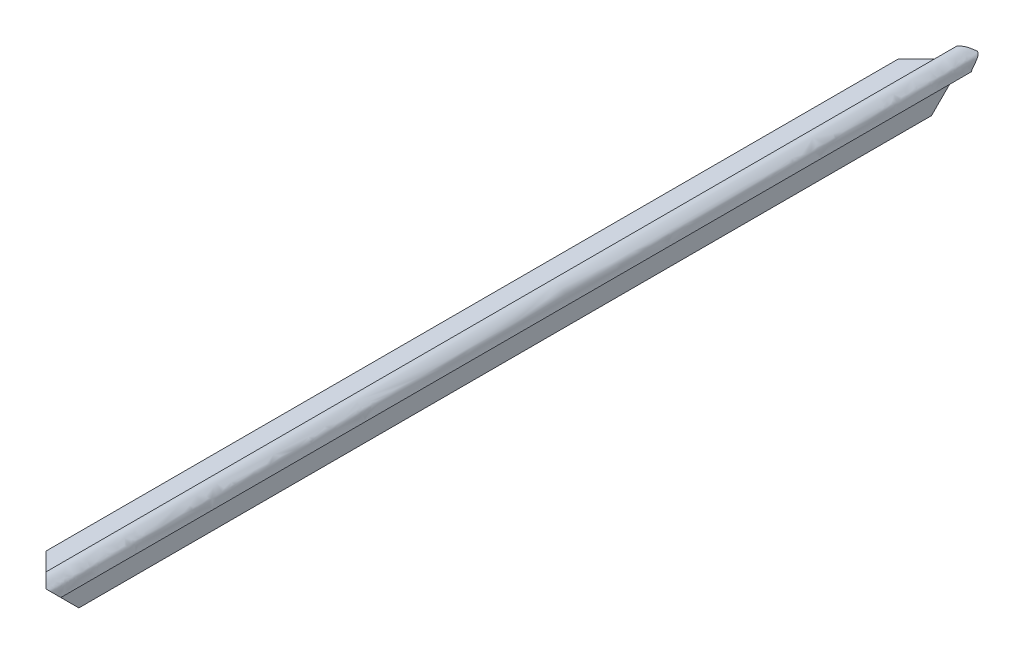
ISO-10303-21;
HEADER;
FILE_DESCRIPTION(('STEP AP214'),'2;1');
FILE_NAME('part.step','',(''),(''),'','','');
FILE_SCHEMA(('AUTOMOTIVE_DESIGN { 1 0 10303 214 1 1 1 1 }'));
ENDSEC;
DATA;
#1=APPLICATION_CONTEXT('core data for automotive mechanical design processes');
#2=APPLICATION_PROTOCOL_DEFINITION('international standard','automotive_design',2000,#1);
#3=PRODUCT_CONTEXT('',#1,'mechanical');
#4=PRODUCT('Part','Part','',(#3));
#5=PRODUCT_RELATED_PRODUCT_CATEGORY('part','',(#4));
#6=PRODUCT_DEFINITION_FORMATION('','',#4);
#7=PRODUCT_DEFINITION_CONTEXT('part definition',#1,'design');
#8=PRODUCT_DEFINITION('design','',#6,#7);
#9=PRODUCT_DEFINITION_SHAPE('','',#8);
#10=(LENGTH_UNIT() NAMED_UNIT(*) SI_UNIT(.MILLI.,.METRE.));
#11=(NAMED_UNIT(*) PLANE_ANGLE_UNIT() SI_UNIT($,.RADIAN.));
#12=(NAMED_UNIT(*) SI_UNIT($,.STERADIAN.) SOLID_ANGLE_UNIT());
#13=UNCERTAINTY_MEASURE_WITH_UNIT(LENGTH_MEASURE(1.E-05),#10,'distance_accuracy_value','');
#14=(GEOMETRIC_REPRESENTATION_CONTEXT(3) GLOBAL_UNCERTAINTY_ASSIGNED_CONTEXT((#13)) GLOBAL_UNIT_ASSIGNED_CONTEXT((#10,
#11,#12)) REPRESENTATION_CONTEXT('',''));
#15=CARTESIAN_POINT('',(0.,0.,0.));
#16=DIRECTION('',(0.,0.,1.));
#17=DIRECTION('',(1.,0.,0.));
#18=AXIS2_PLACEMENT_3D('',#15,#16,#17);
#19=CARTESIAN_POINT('',(-10.4775,-4.500000144,130.175));
#20=DIRECTION('',(0.,1.,0.));
#21=DIRECTION('',(0.,0.,1.));
#22=AXIS2_PLACEMENT_3D('',#19,#20,#21);
#23=PLANE('',#22);
#24=DIRECTION('',(0.,0.,-1.));
#25=VECTOR('',#24,1.);
#26=CARTESIAN_POINT('',(-6.7450641742673,-4.500000144,130.175));
#27=LINE('',#26,#25);
#28=CARTESIAN_POINT('',(-6.7450641742673,-4.500000144,120.254935825733));
#29=VERTEX_POINT('',#28);
#30=CARTESIAN_POINT('',(-6.7450641742673,-4.500000144,-120.254935825733));
#31=VERTEX_POINT('',#30);
#32=EDGE_CURVE('E255',#29,#31,#27,.T.);
#33=ORIENTED_EDGE('',*,*,#32,.F.);
#34=DIRECTION('',(-0.707106781186544,0.,-0.707106781186551));
#35=VECTOR('',#34,1.);
#36=CARTESIAN_POINT('',(-3.65124999999996,-4.500000144,123.34875));
#37=LINE('',#36,#35);
#38=CARTESIAN_POINT('',(-10.4775,-4.500000144,116.5225));
#39=VERTEX_POINT('',#38);
#40=EDGE_CURVE('E206',#29,#39,#37,.T.);
#41=ORIENTED_EDGE('',*,*,#40,.T.);
#42=DIRECTION('',(0.,0.,-1.));
#43=VECTOR('',#42,1.);
#44=CARTESIAN_POINT('',(-10.4775,-4.500000144,130.175));
#45=LINE('',#44,#43);
#46=CARTESIAN_POINT('',(-10.4775,-4.500000144,-116.5225));
#47=VERTEX_POINT('',#46);
#48=EDGE_CURVE('E172',#39,#47,#45,.T.);
#49=ORIENTED_EDGE('',*,*,#48,.T.);
#50=DIRECTION('',(0.707106781186549,0.,-0.707106781186547));
#51=VECTOR('',#50,1.);
#52=CARTESIAN_POINT('',(-133.82625,-4.500000144,6.82624999999959));
#53=LINE('',#52,#51);
#54=EDGE_CURVE('E267',#47,#31,#53,.T.);
#55=ORIENTED_EDGE('',*,*,#54,.T.);
#56=EDGE_LOOP('',(#33,#41,#49,#55));
#57=FACE_BOUND('',#56,.T.);
#58=ADVANCED_FACE('F39',(#57),#23,.F.);
#59=CARTESIAN_POINT('',(-4.50000014400001,-2.53999999999998,130.175));
#60=DIRECTION('',(1.,0.,0.));
#61=DIRECTION('',(0.,1.,0.));
#62=AXIS2_PLACEMENT_3D('',#59,#60,#61);
#63=PLANE('',#62);
#64=DIRECTION('',(0.,0.,-1.));
#65=VECTOR('',#64,1.);
#66=CARTESIAN_POINT('',(-4.50000014400004,-10.4775,130.175));
#67=LINE('',#66,#65);
#68=CARTESIAN_POINT('',(-4.50000014400003,-10.4775,116.5225));
#69=VERTEX_POINT('',#68);
#70=CARTESIAN_POINT('',(-4.50000014400004,-10.4775,-116.5225));
#71=VERTEX_POINT('',#70);
#72=EDGE_CURVE('E155',#69,#71,#67,.T.);
#73=ORIENTED_EDGE('',*,*,#72,.F.);
#74=DIRECTION('',(0.,0.707106781186544,0.707106781186551));
#75=VECTOR('',#74,1.);
#76=CARTESIAN_POINT('',(-4.500000144,0.317500000000019,127.3175));
#77=LINE('',#76,#75);
#78=CARTESIAN_POINT('',(-4.50000014400001,-6.74506417426728,120.254935825733));
#79=VERTEX_POINT('',#78);
#80=EDGE_CURVE('E132',#69,#79,#77,.T.);
#81=ORIENTED_EDGE('',*,*,#80,.T.);
#82=DIRECTION('',(0.,0.,-1.));
#83=VECTOR('',#82,1.);
#84=CARTESIAN_POINT('',(-4.50000014400001,-6.74506417426728,130.175));
#85=LINE('',#84,#83);
#86=CARTESIAN_POINT('',(-4.50000014400002,-6.74506417426726,-120.254935825733));
#87=VERTEX_POINT('',#86);
#88=EDGE_CURVE('E305',#79,#87,#85,.T.);
#89=ORIENTED_EDGE('',*,*,#88,.T.);
#90=DIRECTION('',(0.,-0.707106781186544,0.707106781186551));
#91=VECTOR('',#90,1.);
#92=CARTESIAN_POINT('',(-4.50000014400045,-129.8575,2.8575000000014));
#93=LINE('',#92,#91);
#94=EDGE_CURVE('E285',#87,#71,#93,.T.);
#95=ORIENTED_EDGE('',*,*,#94,.T.);
#96=EDGE_LOOP('',(#73,#81,#89,#95));
#97=FACE_BOUND('',#96,.T.);
#98=ADVANCED_FACE('F303',(#97),#63,.F.);
#99=CARTESIAN_POINT('',(-10.4775,-1.500000048,130.175));
#100=DIRECTION('',(1.,0.,0.));
#101=DIRECTION('',(0.,0.,-1.));
#102=AXIS2_PLACEMENT_3D('',#99,#100,#101);
#103=PLANE('',#102);
#104=ORIENTED_EDGE('',*,*,#48,.F.);
#105=DIRECTION('',(0.,1.,0.));
#106=VECTOR('',#105,1.);
#107=CARTESIAN_POINT('',(-10.4775,-10.4775,116.5225));
#108=LINE('',#107,#106);
#109=CARTESIAN_POINT('',(-10.4775,-1.500000048,116.5225));
#110=VERTEX_POINT('',#109);
#111=EDGE_CURVE('E259',#39,#110,#108,.T.);
#112=ORIENTED_EDGE('',*,*,#111,.T.);
#113=DIRECTION('',(0.,0.,-1.));
#114=VECTOR('',#113,1.);
#115=CARTESIAN_POINT('',(-10.4775,-1.500000048,130.175));
#116=LINE('',#115,#114);
#117=CARTESIAN_POINT('',(-10.4775,-1.500000048,-116.5225));
#118=VERTEX_POINT('',#117);
#119=EDGE_CURVE('E159',#110,#118,#116,.T.);
#120=ORIENTED_EDGE('',*,*,#119,.T.);
#121=DIRECTION('',(0.,1.,0.));
#122=VECTOR('',#121,1.);
#123=CARTESIAN_POINT('',(-10.4775,-10.4775,-116.5225));
#124=LINE('',#123,#122);
#125=EDGE_CURVE('E261',#47,#118,#124,.T.);
#126=ORIENTED_EDGE('',*,*,#125,.F.);
#127=EDGE_LOOP('',(#104,#112,#120,#126));
#128=FACE_BOUND('',#127,.T.);
#129=ADVANCED_FACE('F41',(#128),#103,.F.);
#130=CARTESIAN_POINT('',(-10.4775,-1.500000048,130.175));
#131=DIRECTION('',(0.,-1.,0.));
#132=DIRECTION('',(1.,0.,0.));
#133=AXIS2_PLACEMENT_3D('',#130,#131,#132);
#134=PLANE('',#133);
#135=ORIENTED_EDGE('',*,*,#119,.F.);
#136=DIRECTION('',(0.707106781186544,0.,0.707106781186551));
#137=VECTOR('',#136,1.);
#138=CARTESIAN_POINT('',(-3.65124999999996,-1.500000048,123.34875));
#139=LINE('',#138,#137);
#140=CARTESIAN_POINT('',(-2.54,-1.500000048,124.46));
#141=VERTEX_POINT('',#140);
#142=EDGE_CURVE('E198',#110,#141,#139,.T.);
#143=ORIENTED_EDGE('',*,*,#142,.T.);
#144=DIRECTION('',(0.,0.,-1.));
#145=VECTOR('',#144,1.);
#146=CARTESIAN_POINT('',(-2.54,-1.500000048,130.175));
#147=LINE('',#146,#145);
#148=CARTESIAN_POINT('',(-2.54,-1.500000048,-124.46));
#149=VERTEX_POINT('',#148);
#150=EDGE_CURVE('E168',#141,#149,#147,.T.);
#151=ORIENTED_EDGE('',*,*,#150,.T.);
#152=DIRECTION('',(-0.707106781186549,0.,0.707106781186547));
#153=VECTOR('',#152,1.);
#154=CARTESIAN_POINT('',(-133.82625,-1.50000004799997,6.82624999999959));
#155=LINE('',#154,#153);
#156=EDGE_CURVE('E243',#149,#118,#155,.T.);
#157=ORIENTED_EDGE('',*,*,#156,.T.);
#158=EDGE_LOOP('',(#135,#143,#151,#157));
#159=FACE_BOUND('',#158,.T.);
#160=ADVANCED_FACE('F280',(#159),#134,.F.);
#161=CARTESIAN_POINT('',(-1.50000004800004,-10.4775,130.175));
#162=DIRECTION('',(0.,1.,0.));
#163=DIRECTION('',(-1.,0.,0.));
#164=AXIS2_PLACEMENT_3D('',#161,#162,#163);
#165=PLANE('',#164);
#166=DIRECTION('',(0.,0.,-1.));
#167=VECTOR('',#166,1.);
#168=CARTESIAN_POINT('',(-1.50000004800004,-10.4775,130.175));
#169=LINE('',#168,#167);
#170=CARTESIAN_POINT('',(-1.50000004800002,-10.4775,116.5225));
#171=VERTEX_POINT('',#170);
#172=CARTESIAN_POINT('',(-1.50000004800002,-10.4775,-116.5225));
#173=VERTEX_POINT('',#172);
#174=EDGE_CURVE('E146',#171,#173,#169,.T.);
#175=ORIENTED_EDGE('',*,*,#174,.F.);
#176=DIRECTION('',(-1.,0.,0.));
#177=VECTOR('',#176,1.);
#178=CARTESIAN_POINT('',(1.88228625176079,-10.4775,116.5225));
#179=LINE('',#178,#177);
#180=EDGE_CURVE('E126',#171,#69,#179,.T.);
#181=ORIENTED_EDGE('',*,*,#180,.T.);
#182=ORIENTED_EDGE('',*,*,#72,.T.);
#183=DIRECTION('',(-1.,0.,0.));
#184=VECTOR('',#183,1.);
#185=CARTESIAN_POINT('',(1.88228625176079,-10.4775,-116.5225));
#186=LINE('',#185,#184);
#187=EDGE_CURVE('E139',#173,#71,#186,.T.);
#188=ORIENTED_EDGE('',*,*,#187,.F.);
#189=EDGE_LOOP('',(#175,#181,#182,#188));
#190=FACE_BOUND('',#189,.T.);
#191=ADVANCED_FACE('F153',(#190),#165,.F.);
#192=CARTESIAN_POINT('',(-1.50000004800001,-2.53999999999999,130.175));
#193=DIRECTION('',(-1.,0.,0.));
#194=DIRECTION('',(0.,-1.,0.));
#195=AXIS2_PLACEMENT_3D('',#192,#193,#194);
#196=PLANE('',#195);
#197=DIRECTION('',(0.,0.,-1.));
#198=VECTOR('',#197,1.);
#199=CARTESIAN_POINT('',(-1.50000004800001,-2.53999999999999,130.175));
#200=LINE('',#199,#198);
#201=CARTESIAN_POINT('',(-1.50000004800001,-2.53999999999999,124.46));
#202=VERTEX_POINT('',#201);
#203=CARTESIAN_POINT('',(-1.50000004800001,-2.53999999999999,-124.46));
#204=VERTEX_POINT('',#203);
#205=EDGE_CURVE('E148',#202,#204,#200,.T.);
#206=ORIENTED_EDGE('',*,*,#205,.F.);
#207=DIRECTION('',(0.,-0.707106781186544,-0.707106781186551));
#208=VECTOR('',#207,1.);
#209=CARTESIAN_POINT('',(-1.500000048,0.317500000000009,127.3175));
#210=LINE('',#209,#208);
#211=EDGE_CURVE('E129',#202,#171,#210,.T.);
#212=ORIENTED_EDGE('',*,*,#211,.T.);
#213=ORIENTED_EDGE('',*,*,#174,.T.);
#214=DIRECTION('',(0.,0.707106781186544,-0.707106781186551));
#215=VECTOR('',#214,1.);
#216=CARTESIAN_POINT('',(-1.50000004800045,-129.8575,2.8575000000014));
#217=LINE('',#216,#215);
#218=EDGE_CURVE('E263',#173,#204,#217,.T.);
#219=ORIENTED_EDGE('',*,*,#218,.T.);
#220=EDGE_LOOP('',(#206,#212,#213,#219));
#221=FACE_BOUND('',#220,.T.);
#222=ADVANCED_FACE('F144',(#221),#196,.F.);
#223=CARTESIAN_POINT('',(1.50000004799999,-2.54,130.175));
#224=CARTESIAN_POINT('',(1.2637245905919,-2.34039454064928,130.175));
#225=CARTESIAN_POINT('',(1.29771353925682,-0.292226778809328,130.175));
#226=CARTESIAN_POINT('',(-0.0424672575822147,0.473225958357868,130.175));
#227=CARTESIAN_POINT('',(-1.29564908722829,1.63551293408737,130.175));
#228=CARTESIAN_POINT('',(-2.54,1.500000048,130.175));
#229=B_SPLINE_CURVE_WITH_KNOTS('',3,(#223,#224,#225,#226,#227,#228),.UNSPECIFIED.,.F.,.F.,(4,1,
1,4),(0.,0.158392958717859,0.403052951545895,0.899739923780143),.UNSPECIFIED.);
#230=DIRECTION('',(0.,0.,-1.));
#231=VECTOR('',#230,1.);
#232=SURFACE_OF_LINEAR_EXTRUSION('',#229,#231);
#233=CARTESIAN_POINT('',(-2.54,1.500000048,124.46));
#234=CARTESIAN_POINT('',(-2.47250829949962,1.50736563174085,124.5274917005));
#235=CARTESIAN_POINT('',(-2.40486894988378,1.51215736755173,124.595131050116));
#236=CARTESIAN_POINT('',(-2.26952255762361,1.51642262748635,124.730477442376));
#237=CARTESIAN_POINT('',(-2.20181553333837,1.51589733189138,124.798184466662));
#238=CARTESIAN_POINT('',(-2.06654192886566,1.50936195001081,124.933458071134));
#239=CARTESIAN_POINT('',(-1.99897532818474,1.50335273003666,125.001024671815));
#240=CARTESIAN_POINT('',(-1.86513245000334,1.48593464503524,125.134867549997));
#241=CARTESIAN_POINT('',(-1.7988512372539,1.47460147655497,125.201148762746));
#242=CARTESIAN_POINT('',(-1.66685433087651,1.44664564738663,125.333145669123));
#243=CARTESIAN_POINT('',(-1.60113859972329,1.43002334050878,125.398861400277));
#244=CARTESIAN_POINT('',(-1.47046863861015,1.39170129074597,125.52953136139));
#245=CARTESIAN_POINT('',(-1.4055142655175,1.37000251883325,125.594485734483));
#246=CARTESIAN_POINT('',(-1.2646529455123,1.31743117820409,125.735347054488));
#247=CARTESIAN_POINT('',(-1.18892385048768,1.28560581832751,125.811076149512));
#248=CARTESIAN_POINT('',(-1.03883661955591,1.21602819974966,125.961163380444));
#249=CARTESIAN_POINT('',(-0.964478742076256,1.17827483632542,126.035521257924));
#250=CARTESIAN_POINT('',(-0.817046096852071,1.09770014336352,126.182953903148));
#251=CARTESIAN_POINT('',(-0.743973169139359,1.05487213362457,126.256026830861));
#252=CARTESIAN_POINT('',(-0.599073684512029,0.965225833431733,126.400926315488));
#253=CARTESIAN_POINT('',(-0.527247118467079,0.918407572223638,126.472752881533));
#254=CARTESIAN_POINT('',(-0.385322749423827,0.822429408344859,126.614677250576));
#255=CARTESIAN_POINT('',(-0.315214695705584,0.773299527518938,126.684785304294));
#256=CARTESIAN_POINT('',(-0.175570621902015,0.673445336748486,126.824429378098));
#257=CARTESIAN_POINT('',(-0.106034627721456,0.62272095509562,126.893965372279));
#258=CARTESIAN_POINT('',(-0.00172876905366558,0.546391635915446,126.998271230946));
#259=CARTESIAN_POINT('',(0.0330762971404363,0.520881460677099,127.03307629714));
#260=CARTESIAN_POINT('',(0.102732263689063,0.469988022558667,127.102732263689));
#261=CARTESIAN_POINT('',(0.137583163310336,0.444604757678705,127.13758316331));
#262=CARTESIAN_POINT('',(0.207399537598542,0.394161134848413,127.207399537599));
#263=CARTESIAN_POINT('',(0.242365005224287,0.369100757504034,127.242365005224));
#264=CARTESIAN_POINT('',(0.294963670997168,0.331934864882641,127.294963670997));
#265=CARTESIAN_POINT('',(0.312521744908509,0.319616938811229,127.312521744909));
#266=CARTESIAN_POINT('',(0.347686591555322,0.295120783948547,127.347686591555));
#267=CARTESIAN_POINT('',(0.365293364710334,0.282942556365451,127.36529336471));
#268=CARTESIAN_POINT('',(0.400887997560297,0.258310292935772,127.40088799756));
#269=CARTESIAN_POINT('',(0.418875784818475,0.245856040420517,127.418875784818));
#270=CARTESIAN_POINT('',(0.454797172621956,0.220793176036565,127.454797172622));
#271=CARTESIAN_POINT('',(0.472730773362915,0.208184564726054,127.472730773363));
#272=CARTESIAN_POINT('',(0.52637725791374,0.16988937230977,127.526377257914));
#273=CARTESIAN_POINT('',(0.561928273135093,0.14373850042722,127.561928273135));
#274=CARTESIAN_POINT('',(0.631913728945611,0.0890706953568862,127.631913728946));
#275=CARTESIAN_POINT('',(0.6663525538692,0.0605652005611223,127.666352553869));
#276=CARTESIAN_POINT('',(0.733599111047132,-8.430863609183E-05,127.733599111047));
#277=CARTESIAN_POINT('',(0.766407823848546,-0.0322260966431503,127.766407823849));
#278=CARTESIAN_POINT('',(0.820679466186111,-0.0913231086608626,127.820679466186));
#279=CARTESIAN_POINT('',(0.842734111098866,-0.117187223398907,127.842734111099));
#280=CARTESIAN_POINT('',(0.885270641654371,-0.171390080387358,127.885270641654));
#281=CARTESIAN_POINT('',(0.905752779350085,-0.199728424487344,127.90575277935));
#282=CARTESIAN_POINT('',(0.944874529600354,-0.258860993062256,127.9448745296));
#283=CARTESIAN_POINT('',(0.963513752890937,-0.289655733910854,127.963513752891));
#284=CARTESIAN_POINT('',(0.998760569959361,-0.353503092498239,127.998760569959));
#285=CARTESIAN_POINT('',(1.0153675569327,-0.386556380046691,128.015367556933));
#286=CARTESIAN_POINT('',(1.04641054558578,-0.454463894839942,128.046410545586));
#287=CARTESIAN_POINT('',(1.06085431869926,-0.489311039914656,128.060854318699));
#288=CARTESIAN_POINT('',(1.08768147349713,-0.560558955495604,128.087681473497));
#289=CARTESIAN_POINT('',(1.10006438404073,-0.596960078878704,128.100064384041));
#290=CARTESIAN_POINT('',(1.12290109613221,-0.671014580123578,128.122901096132));
#291=CARTESIAN_POINT('',(1.13335174932356,-0.708669885749833,128.133351749324));
#292=CARTESIAN_POINT('',(1.1524607173791,-0.784869036570964,128.152460717379));
#293=CARTESIAN_POINT('',(1.161119153107,-0.823412821653538,128.161119153107));
#294=CARTESIAN_POINT('',(1.17575911686328,-0.895826660364743,128.175759116863));
#295=CARTESIAN_POINT('',(1.18194479100444,-0.929615120823054,128.181944791004));
#296=CARTESIAN_POINT('',(1.19321454424208,-0.997552545945655,128.193214544242));
#297=CARTESIAN_POINT('',(1.19829866734578,-1.03170149615111,128.198298667346));
#298=CARTESIAN_POINT('',(1.20764776851529,-1.10019995183767,128.207647768515));
#299=CARTESIAN_POINT('',(1.21191314598833,-1.13454935106397,128.211913145988));
#300=CARTESIAN_POINT('',(1.21989959047052,-1.20337353402157,128.219899590471));
#301=CARTESIAN_POINT('',(1.22362063871647,-1.23784832203311,128.223620638717));
#302=CARTESIAN_POINT('',(1.23427236887226,-1.34142022483723,128.234272368872));
#303=CARTESIAN_POINT('',(1.24068616923805,-1.41062053163568,128.240686169238));
#304=CARTESIAN_POINT('',(1.25339438339961,-1.54902489699083,128.2533943834));
#305=CARTESIAN_POINT('',(1.25968882401073,-1.61822895111642,128.259688824011));
#306=CARTESIAN_POINT('',(1.27265049811952,-1.74964216077826,128.27265049812));
#307=CARTESIAN_POINT('',(1.27922022024393,-1.81187002570824,128.279220220244));
#308=CARTESIAN_POINT('',(1.29428711426387,-1.93620272748824,128.294287114264));
#309=CARTESIAN_POINT('',(1.30279323580675,-1.99830559789973,128.302793235807));
#310=CARTESIAN_POINT('',(1.31831047388817,-2.09103705811247,128.318310473888));
#311=CARTESIAN_POINT('',(1.32399429541464,-2.12210168664529,128.323994295415));
#312=CARTESIAN_POINT('',(1.33663842652531,-2.18376244432156,128.336638426525));
#313=CARTESIAN_POINT('',(1.34360030039708,-2.21435794900167,128.343600300397));
#314=CARTESIAN_POINT('',(1.35919995803118,-2.27443915493527,128.359199958031));
#315=CARTESIAN_POINT('',(1.36782465712409,-2.30393150379517,128.367824657124));
#316=CARTESIAN_POINT('',(1.38741316060578,-2.36128886863205,128.387413160606));
#317=CARTESIAN_POINT('',(1.39836961539302,-2.38915865527095,128.398369615393));
#318=CARTESIAN_POINT('',(1.41990755156659,-2.43449310431909,128.419907551566));
#319=CARTESIAN_POINT('',(1.42972257050191,-2.45267486703729,128.429722570502));
#320=CARTESIAN_POINT('',(1.45124697691559,-2.48658823842234,128.451246976916));
#321=CARTESIAN_POINT('',(1.46294730421627,-2.50233089212049,128.462947304216));
#322=CARTESIAN_POINT('',(1.47948807883705,-2.52060615683794,128.479488078837));
#323=CARTESIAN_POINT('',(1.48346453652644,-2.52473402309642,128.483464536526));
#324=CARTESIAN_POINT('',(1.49159906872968,-2.53263927118418,128.49159906873));
#325=CARTESIAN_POINT('',(1.49575747654393,-2.53641596650699,128.495757476544));
#326=CARTESIAN_POINT('',(1.50000004799999,-2.54,128.500000048));
#327=B_SPLINE_CURVE_WITH_KNOTS('',3,(#233,#234,#235,#236,#237,#238,#239,#240,#241,#242,#243,
#244,#245,#246,#247,#248,#249,#250,#251,#252,#253,#254,#255,#256,#257,#258,#259,#260,#261,#262,
#263,#264,#265,#266,#267,#268,#269,#270,#271,#272,#273,#274,#275,#276,#277,#278,#279,#280,#281,
#282,#283,#284,#285,#286,#287,#288,#289,#290,#291,#292,#293,#294,#295,#296,#297,#298,#299,#300,
#301,#302,#303,#304,#305,#306,#307,#308,#309,#310,#311,#312,#313,#314,#315,#316,#317,#318,#319,
#320,#321,#322,#323,#324,#325,#326),.UNSPECIFIED.,.F.,.F.,(4,2,2,2,2,2,2,2,2,2,2,2,2,2,2,2,2,2,
2,2,2,2,2,2,2,2,2,2,2,2,2,2,2,2,2,2,2,2,2,2,2,2,2,2,2,2,4),(0.,0.287174908015305,
0.574286069982556,0.861351884016387,1.1444542788389,1.42753773986414,1.7105670998989,
2.04554309262246,2.38058158460627,2.71606612213849,3.05154820101077,3.38348021399538,
3.71542717613594,3.88174636097296,4.04806291660931,4.2143694355281,4.2975237129482,
4.38067870898044,4.4656492075651,4.55061939897252,4.72059523846434,4.8897891136116,
5.05887995135606,5.18031754144565,5.30173562581438,5.42317930180396,5.54465915158067,
5.66569153413269,5.78675154841255,5.90800710831076,6.02925448830096,6.13392262222027,
6.23858657385202,6.34319933696484,6.44781570526007,6.65718341898139,6.86650352516997,
7.0552418310667,7.24487082467382,7.34109729075327,7.43744232928198,7.53305808551733,
7.62837681381845,7.69680082259284,7.76490531116658,7.78582200862812,7.80677877247072),.UNSPECIFIED.);
#328=CARTESIAN_POINT('',(-2.54,1.500000048,124.46));
#329=VERTEX_POINT('',#328);
#330=CARTESIAN_POINT('',(0.316711429923878,0.31671142994239,127.316711429924));
#331=VERTEX_POINT('',#330);
#332=EDGE_CURVE('E187',#329,#331,#327,.T.);
#333=ORIENTED_EDGE('',*,*,#332,.T.);
#334=CARTESIAN_POINT('',(-2.54,1.500000048,128.500000048));
#335=CARTESIAN_POINT('',(-2.48514269894066,1.50599583370249,128.505995833702));
#336=CARTESIAN_POINT('',(-2.42989757240955,1.51030052711328,128.510300527113));
#337=CARTESIAN_POINT('',(-2.31908400216175,1.5153857585921,128.515385758592));
#338=CARTESIAN_POINT('',(-2.2635155443598,1.51616614196241,128.516166141962));
#339=CARTESIAN_POINT('',(-2.15278700203711,1.51406543826865,128.514065438269));
#340=CARTESIAN_POINT('',(-2.09762625694295,1.51120243849587,128.511202438496));
#341=CARTESIAN_POINT('',(-1.98793067791563,1.50187628653224,128.501876286532));
#342=CARTESIAN_POINT('',(-1.93339571819947,1.49541387123554,128.495413871236));
#343=CARTESIAN_POINT('',(-1.8292646031507,1.47964123953835,128.479641239538));
#344=CARTESIAN_POINT('',(-1.77959546896175,1.47056944381428,128.470569443814));
#345=CARTESIAN_POINT('',(-1.68142292266971,1.44968271370725,128.449682713707));
#346=CARTESIAN_POINT('',(-1.63291968619666,1.43786736886034,128.43786736886));
#347=CARTESIAN_POINT('',(-1.53743931788634,1.4118111444763,128.411811144476));
#348=CARTESIAN_POINT('',(-1.49045740487321,1.39757897095868,128.397578970959));
#349=CARTESIAN_POINT('',(-1.39793593103699,1.36695271012456,128.366952710125));
#350=CARTESIAN_POINT('',(-1.35239636743658,1.35055862697125,128.350558626971));
#351=CARTESIAN_POINT('',(-1.23808832950343,1.3063498851155,128.306349885116));
#352=CARTESIAN_POINT('',(-1.17033794946558,1.27721762147475,128.277217621475));
#353=CARTESIAN_POINT('',(-1.03806260446141,1.21540505513304,128.215405055133));
#354=CARTESIAN_POINT('',(-0.973542632729837,1.18271949322243,128.182719493222));
#355=CARTESIAN_POINT('',(-0.847370401180608,1.11464508496264,128.114645084963));
#356=CARTESIAN_POINT('',(-0.785720304232279,1.07925425121561,128.079254251216));
#357=CARTESIAN_POINT('',(-0.663694182794278,1.00578494397282,128.005784943973));
#358=CARTESIAN_POINT('',(-0.603364715898702,0.96766814635589,127.967668146356));
#359=CARTESIAN_POINT('',(-0.48472157083044,0.889999363914981,127.889999363915));
#360=CARTESIAN_POINT('',(-0.426405744638419,0.850449006863311,127.850449006863));
#361=CARTESIAN_POINT('',(-0.311199963429795,0.770416804819528,127.77041680482));
#362=CARTESIAN_POINT('',(-0.254308543054112,0.729936006834491,127.729936006834));
#363=CARTESIAN_POINT('',(-0.150124158909159,0.654824789372257,127.654824789372));
#364=CARTESIAN_POINT('',(-0.1027217820994,0.620269708500064,127.6202697085));
#365=CARTESIAN_POINT('',(-0.00806201475537873,0.551044932535848,127.551044932536));
#366=CARTESIAN_POINT('',(0.0391953390634451,0.516375212402576,127.516375212403));
#367=CARTESIAN_POINT('',(0.110331024125798,0.464466132180887,127.464466132181));
#368=CARTESIAN_POINT('',(0.134111243460795,0.447159735269617,127.44715973527));
#369=CARTESIAN_POINT('',(0.181797429455264,0.412634441166099,127.412634441166));
#370=CARTESIAN_POINT('',(0.205703393583602,0.395415542226206,127.395415542226));
#371=CARTESIAN_POINT('',(0.25379926730414,0.361027355014315,127.361027355014));
#372=CARTESIAN_POINT('',(0.27798996131293,0.343858612648053,127.343858612648));
#373=CARTESIAN_POINT('',(0.326653832438186,0.309722147139855,127.30972214714));
#374=CARTESIAN_POINT('',(0.351127017344144,0.292754429567308,127.292754429567));
#375=CARTESIAN_POINT('',(0.399489831771585,0.259270598329743,127.25927059833));
#376=CARTESIAN_POINT('',(0.423378610967902,0.24275388841174,127.242753888412));
#377=CARTESIAN_POINT('',(0.470869291195235,0.209517878240752,127.209517878241));
#378=CARTESIAN_POINT('',(0.494471193899406,0.192798579170469,127.19279857917));
#379=CARTESIAN_POINT('',(0.564214438646804,0.14212526962303,127.142125269623));
#380=CARTESIAN_POINT('',(0.609474111554457,0.10753713554179,127.107537135542));
#381=CARTESIAN_POINT('',(0.673741110606493,0.0536876423782551,127.053687642378));
#382=CARTESIAN_POINT('',(0.694496188159281,0.0354741578827504,127.035474157883));
#383=CARTESIAN_POINT('',(0.73467477177889,-0.0016709468609653,126.998329053139));
#384=CARTESIAN_POINT('',(0.7540983256151,-0.0206025413085658,126.979397458691));
#385=CARTESIAN_POINT('',(0.810026334111936,-0.0783514116796189,126.92164858832));
#386=CARTESIAN_POINT('',(0.844341071077344,-0.118248945069294,126.881751054931));
#387=CARTESIAN_POINT('',(0.900556136103995,-0.192059362415886,126.807940637584));
#388=CARTESIAN_POINT('',(0.923564642127755,-0.22555772524834,126.774442274752));
#389=CARTESIAN_POINT('',(0.966002244353529,-0.293676620272119,126.706323379728));
#390=CARTESIAN_POINT('',(0.98542988354815,-0.328297602534669,126.671702397465));
#391=CARTESIAN_POINT('',(1.03925077481205,-0.43390806721134,126.566091932789));
#392=CARTESIAN_POINT('',(1.06881094980684,-0.506132625555184,126.493867374445));
#393=CARTESIAN_POINT('',(1.106346477754,-0.616262624148423,126.383737375852));
#394=CARTESIAN_POINT('',(1.11779898848284,-0.653633411173722,126.346366588826));
#395=CARTESIAN_POINT('',(1.13864035456859,-0.728667636114668,126.271332363885));
#396=CARTESIAN_POINT('',(1.14802921070247,-0.766331073920126,126.23366892608));
#397=CARTESIAN_POINT('',(1.16503543615372,-0.841731542808693,126.158268457191));
#398=CARTESIAN_POINT('',(1.17265827014945,-0.879467972407375,126.120532027593));
#399=CARTESIAN_POINT('',(1.18639654202518,-0.95507622971696,126.044923770283));
#400=CARTESIAN_POINT('',(1.19251200219104,-0.992948055417692,126.007051944582));
#401=CARTESIAN_POINT('',(1.20349114462997,-1.06833564558815,125.931664354412));
#402=CARTESIAN_POINT('',(1.2083685351343,-1.10585043938611,125.894149560614));
#403=CARTESIAN_POINT('',(1.21739848628453,-1.18092302542494,125.819076974575));
#404=CARTESIAN_POINT('',(1.22155103606982,-1.2184808183016,125.781519181698));
#405=CARTESIAN_POINT('',(1.23334291180607,-1.33124834926853,125.668751650731));
#406=CARTESIAN_POINT('',(1.24030876626354,-1.40649237343189,125.593507626568));
#407=CARTESIAN_POINT('',(1.2540615148157,-1.5563062378519,125.443693762148));
#408=CARTESIAN_POINT('',(1.26084945504957,-1.63087605441993,125.36912394558));
#409=CARTESIAN_POINT('',(1.27575020315195,-1.77993043443865,125.220069565561));
#410=CARTESIAN_POINT('',(1.28386251745937,-1.85441501927909,125.145584980721));
#411=CARTESIAN_POINT('',(1.29763833389686,-1.95883890102879,125.041161098971));
#412=CARTESIAN_POINT('',(1.30187982782176,-1.9888698303465,125.011130169653));
#413=CARTESIAN_POINT('',(1.31113960962397,-2.04887847613275,124.951121523867));
#414=CARTESIAN_POINT('',(1.31615804977739,-2.07885618100219,124.921143818998));
#415=CARTESIAN_POINT('',(1.32728710018613,-2.13887261891507,124.861127381085));
#416=CARTESIAN_POINT('',(1.33340328592868,-2.16891085098708,124.831089149013));
#417=CARTESIAN_POINT('',(1.34716171068401,-2.22880304266955,124.77119695733));
#418=CARTESIAN_POINT('',(1.35480342696441,-2.25865706179922,124.741342938201));
#419=CARTESIAN_POINT('',(1.37265219244851,-2.31912797082513,124.680872029175));
#420=CARTESIAN_POINT('',(1.38294176107149,-2.34973358429339,124.650266415706));
#421=CARTESIAN_POINT('',(1.40135776199795,-2.39490863314217,124.605091366858));
#422=CARTESIAN_POINT('',(1.40795965841356,-2.40978410693223,124.590215893068));
#423=CARTESIAN_POINT('',(1.42253044820788,-2.43919508732698,124.560804912673));
#424=CARTESIAN_POINT('',(1.43049860755983,-2.45373077174357,124.546269228256));
#425=CARTESIAN_POINT('',(1.44743495398613,-2.48071302451544,124.519286975484));
#426=CARTESIAN_POINT('',(1.45620874712859,-2.49321813456325,124.506781865437));
#427=CARTESIAN_POINT('',(1.4710850970524,-2.51135607178812,124.488643928212));
#428=CARTESIAN_POINT('',(1.47635802971605,-2.51732470237699,124.482675297623));
#429=CARTESIAN_POINT('',(1.48761458992443,-2.52893818587477,124.471061814125));
#430=CARTESIAN_POINT('',(1.49360009791108,-2.53458212106979,124.46541787893));
#431=CARTESIAN_POINT('',(1.50000004799999,-2.54,124.46));
#432=B_SPLINE_CURVE_WITH_KNOTS('',3,(#334,#335,#336,#337,#338,#339,#340,#341,#342,#343,#344,
#345,#346,#347,#348,#349,#350,#351,#352,#353,#354,#355,#356,#357,#358,#359,#360,#361,#362,#363,
#364,#365,#366,#367,#368,#369,#370,#371,#372,#373,#374,#375,#376,#377,#378,#379,#380,#381,#382,
#383,#384,#385,#386,#387,#388,#389,#390,#391,#392,#393,#394,#395,#396,#397,#398,#399,#400,#401,
#402,#403,#404,#405,#406,#407,#408,#409,#410,#411,#412,#413,#414,#415,#416,#417,#418,#419,#420,
#421,#422,#423,#424,#425,#426,#427,#428,#429,#430,#431),.UNSPECIFIED.,.F.,.F.,(4,2,2,2,2,2,2,2,
2,2,2,2,2,2,2,2,2,2,2,2,2,2,2,2,2,2,2,2,2,2,2,2,2,2,2,2,2,2,2,2,2,2,2,2,2,2,2,2,4),(0.,
0.166501604451006,0.333010517330689,0.498696025283428,0.66434762555716,0.818077666802322,
0.971830722522111,1.12504123511463,1.27825145267409,1.51583140579339,1.75376791411113,
1.99188093155072,2.23452431715761,2.47690032463708,2.71901578931573,2.92325946890573,
3.12755117734468,3.22992610302343,3.33229897580957,3.4351193610376,3.53794258827257,
3.63817238279501,3.73840159246461,3.93812008663949,4.03731729700554,4.13651094673451,
4.33419685884769,4.49203930149689,4.64994582705368,4.96818123945711,5.13039489746897,
5.29260849440755,5.45431323508035,5.61601558487656,5.77584065699245,5.93566812362797,
6.25557805063976,6.5726103987004,6.88952486532024,7.01756373338589,7.14562772803039,
7.27436158438962,7.40305140478622,7.53637859979418,7.60249197459619,7.6685699405507,
7.72767166961525,7.7574975418241,7.78740394412484),.UNSPECIFIED.);
#433=CARTESIAN_POINT('',(1.50000004799999,-2.54,124.46));
#434=VERTEX_POINT('',#433);
#435=EDGE_CURVE('E62',#331,#434,#432,.T.);
#436=ORIENTED_EDGE('',*,*,#435,.T.);
#437=DIRECTION('',(0.,0.,-1.));
#438=VECTOR('',#437,1.);
#439=CARTESIAN_POINT('',(1.50000004799999,-2.54,130.175));
#440=LINE('',#439,#438);
#441=CARTESIAN_POINT('',(1.50000004799999,-2.54,-124.46));
#442=VERTEX_POINT('',#441);
#443=EDGE_CURVE('E204',#434,#442,#440,.T.);
#444=ORIENTED_EDGE('',*,*,#443,.T.);
#445=CARTESIAN_POINT('',(1.50000004799999,-2.54,-124.46));
#446=CARTESIAN_POINT('',(1.49411818637402,-2.53502303842105,-124.464976961579));
#447=CARTESIAN_POINT('',(1.48858723521207,-2.52985294472123,-124.470147055279));
#448=CARTESIAN_POINT('',(1.4781357201231,-2.5192276353846,-124.480772364615));
#449=CARTESIAN_POINT('',(1.47321387638039,-2.51377305301836,-124.486226946982));
#450=CARTESIAN_POINT('',(1.45925365692111,-2.49717550895967,-124.50282449104));
#451=CARTESIAN_POINT('',(1.4509439506341,-2.48572906179237,-124.514270938208));
#452=CARTESIAN_POINT('',(1.43581385697891,-2.46253103795099,-124.537468962049));
#453=CARTESIAN_POINT('',(1.42897744470182,-2.4507844826141,-124.549215517386));
#454=CARTESIAN_POINT('',(1.41630800365829,-2.42699822160871,-124.573001778391));
#455=CARTESIAN_POINT('',(1.41047717369132,-2.41495793763525,-124.585042062365));
#456=CARTESIAN_POINT('',(1.39836641653109,-2.38795844203701,-124.612041557963));
#457=CARTESIAN_POINT('',(1.39228373237512,-2.3729555890723,-124.627044410928));
#458=CARTESIAN_POINT('',(1.38100262015313,-2.34278327904561,-124.657216720954));
#459=CARTESIAN_POINT('',(1.37580443819749,-2.32761377685979,-124.67238622314));
#460=CARTESIAN_POINT('',(1.36122543533606,-2.28192605233931,-124.718073947661));
#461=CARTESIAN_POINT('',(1.35286727035088,-2.25124577501334,-124.748754224987));
#462=CARTESIAN_POINT('',(1.33790318703316,-2.18965835621395,-124.810341643786));
#463=CARTESIAN_POINT('',(1.33129867685638,-2.15875105278299,-124.841248947217));
#464=CARTESIAN_POINT('',(1.31920094700091,-2.09622843170318,-124.903771568297));
#465=CARTESIAN_POINT('',(1.31373134102976,-2.06461085888894,-124.935389141111));
#466=CARTESIAN_POINT('',(1.30370005256203,-2.00134061803846,-124.998659381962));
#467=CARTESIAN_POINT('',(1.29913738405497,-1.96968802615466,-125.030311973845));
#468=CARTESIAN_POINT('',(1.29066312003335,-1.90635365266138,-125.093646347339));
#469=CARTESIAN_POINT('',(1.28675124512337,-1.87467188948025,-125.12532811052));
#470=CARTESIAN_POINT('',(1.27565356424492,-1.77921274296268,-125.220787257037));
#471=CARTESIAN_POINT('',(1.26916008350711,-1.71539590174813,-125.284604098252));
#472=CARTESIAN_POINT('',(1.25688065228491,-1.5877014759518,-125.412298524048));
#473=CARTESIAN_POINT('',(1.25109503150278,-1.52382387692458,-125.476176123075));
#474=CARTESIAN_POINT('',(1.23932551094608,-1.39603630388857,-125.603963696111));
#475=CARTESIAN_POINT('',(1.23334148925945,-1.33212633465926,-125.667873665341));
#476=CARTESIAN_POINT('',(1.22348220892034,-1.23663222405431,-125.763367775946));
#477=CARTESIAN_POINT('',(1.22006842028469,-1.20502480177835,-125.794975198222));
#478=CARTESIAN_POINT('',(1.212778773396,-1.1418364792563,-125.858163520744));
#479=CARTESIAN_POINT('',(1.20890291686052,-1.11025557891208,-125.889744421088));
#480=CARTESIAN_POINT('',(1.20048420563939,-1.04715487718001,-125.95284512282));
#481=CARTESIAN_POINT('',(1.19594173132188,-1.01563505126685,-125.984364948733));
#482=CARTESIAN_POINT('',(1.18591041620123,-0.952671357263366,-126.047328642737));
#483=CARTESIAN_POINT('',(1.18042156932883,-0.921227489661484,-126.078772510338));
#484=CARTESIAN_POINT('',(1.16236945423686,-0.827073940970994,-126.172926059029));
#485=CARTESIAN_POINT('',(1.14821611529121,-0.764505870786385,-126.235494129214));
#486=CARTESIAN_POINT('',(1.12102789270052,-0.664614265132744,-126.335385734867));
#487=CARTESIAN_POINT('',(1.10974715135503,-0.62705170108769,-126.372948298912));
#488=CARTESIAN_POINT('',(1.08475922339821,-0.552313457129405,-126.447686542871));
#489=CARTESIAN_POINT('',(1.07105125311934,-0.515137906286016,-126.484862093714));
#490=CARTESIAN_POINT('',(1.04075899575605,-0.441336486539155,-126.558663513461));
#491=CARTESIAN_POINT('',(1.02417229462508,-0.40471110723309,-126.595288892767));
#492=CARTESIAN_POINT('',(0.987657260042319,-0.332331383057787,-126.667668616942));
#493=CARTESIAN_POINT('',(0.967732070662724,-0.296576254565867,-126.703423745434));
#494=CARTESIAN_POINT('',(0.924087506852601,-0.226280217787331,-126.773719782213));
#495=CARTESIAN_POINT('',(0.900372472696305,-0.191737974999916,-126.808262025));
#496=CARTESIAN_POINT('',(0.848912330695527,-0.12433351829634,-126.875666481704));
#497=CARTESIAN_POINT('',(0.821181609744913,-0.0914658504631449,-126.908534149537));
#498=CARTESIAN_POINT('',(0.766904989290903,-0.0331927870785362,-126.966807212921));
#499=CARTESIAN_POINT('',(0.740999747922767,-0.00748747308229321,-126.992512526918));
#500=CARTESIAN_POINT('',(0.686750943553583,0.0426029162056718,-127.042602916206));
#501=CARTESIAN_POINT('',(0.65840700337818,0.0669877863210442,-127.066987786321));
#502=CARTESIAN_POINT('',(0.599647737719852,0.114704937945777,-127.114704937946));
#503=CARTESIAN_POINT('',(0.569221642400481,0.138030515644659,-127.138030515645));
#504=CARTESIAN_POINT('',(0.507131250573557,0.183839709948171,-127.183839709948));
#505=CARTESIAN_POINT('',(0.475466692032928,0.206323146381668,-127.206323146382));
#506=CARTESIAN_POINT('',(0.411441545128597,0.251082822770206,-127.25108282277));
#507=CARTESIAN_POINT('',(0.379077755481462,0.273356739606168,-127.273356739606));
#508=CARTESIAN_POINT('',(0.330739030202782,0.306913209570389,-127.30691320957));
#509=CARTESIAN_POINT('',(0.314662160979494,0.318121873458795,-127.318121873459));
#510=CARTESIAN_POINT('',(0.282627328258316,0.340623825046456,-127.340623825046));
#511=CARTESIAN_POINT('',(0.266669364820935,0.35191711278877,-127.351917112789));
#512=CARTESIAN_POINT('',(0.218909874807721,0.385901993434622,-127.385901993435));
#513=CARTESIAN_POINT('',(0.187240421868008,0.408686300796657,-127.408686300797));
#514=CARTESIAN_POINT('',(0.124114262559146,0.45440568727925,-127.454405687279));
#515=CARTESIAN_POINT('',(0.0926575777813338,0.477340781249131,-127.477340781249));
#516=CARTESIAN_POINT('',(0.0292436113559643,0.523692149026579,-127.523692149027));
#517=CARTESIAN_POINT('',(-0.00271214613457047,0.547109464513685,-127.547109464514));
#518=CARTESIAN_POINT('',(-0.0666662326626638,0.593913470016621,-127.593913470017));
#519=CARTESIAN_POINT('',(-0.0986645603939671,0.617300160930369,-127.61730016093));
#520=CARTESIAN_POINT('',(-0.19464947167082,0.687102175877738,-127.687102175878));
#521=CARTESIAN_POINT('',(-0.258882566328792,0.733349805662794,-127.733349805663));
#522=CARTESIAN_POINT('',(-0.388730766084323,0.824622563423499,-127.824622563424));
#523=CARTESIAN_POINT('',(-0.454341667545804,0.869650657230118,-127.86965065723));
#524=CARTESIAN_POINT('',(-0.587943624900992,0.957898522544802,-127.957898522545));
#525=CARTESIAN_POINT('',(-0.655933946014992,1.00111884341052,-128.00111884341));
#526=CARTESIAN_POINT('',(-0.776100259540031,1.07345772786015,-128.07345772786));
#527=CARTESIAN_POINT('',(-0.827519539900041,1.10320188398888,-128.103201883989));
#528=CARTESIAN_POINT('',(-0.932407995728032,1.16092823207243,-128.160928232072));
#529=CARTESIAN_POINT('',(-0.985879498972891,1.18890832201413,-128.188908322014));
#530=CARTESIAN_POINT('',(-1.09456223018584,1.24234471124156,-128.242344711242));
#531=CARTESIAN_POINT('',(-1.14975219247442,1.26782239800548,-128.267822398006));
#532=CARTESIAN_POINT('',(-1.26245544913368,1.3159971213295,-128.31599712133));
#533=CARTESIAN_POINT('',(-1.31996739990866,1.3386957361567,-128.338695736157));
#534=CARTESIAN_POINT('',(-1.47751747772204,1.39505448092902,-128.395054480929));
#535=CARTESIAN_POINT('',(-1.5798618421858,1.42566254300745,-128.425662543007));
#536=CARTESIAN_POINT('',(-1.7378024214278,1.46224628357271,-128.462246283573));
#537=CARTESIAN_POINT('',(-1.79128308642275,1.47289644748398,-128.472896447484));
#538=CARTESIAN_POINT('',(-1.89938221991888,1.49077747164733,-128.490777471647));
#539=CARTESIAN_POINT('',(-1.95400036040915,1.49800930376227,-128.498009303762));
#540=CARTESIAN_POINT('',(-2.0529491404742,1.50777490243638,-128.507774902436));
#541=CARTESIAN_POINT('',(-2.09715393628062,1.51095879281611,-128.510958792816));
#542=CARTESIAN_POINT('',(-2.18577939541213,1.51498365980302,-128.514983659803));
#543=CARTESIAN_POINT('',(-2.2302000600724,1.51582462190034,-128.5158246219));
#544=CARTESIAN_POINT('',(-2.31902380924985,1.51518469672605,-128.515184696726));
#545=CARTESIAN_POINT('',(-2.36342687727878,1.51370278141425,-128.513702781414));
#546=CARTESIAN_POINT('',(-2.45196741641012,1.5085046116009,-128.508504611601));
#547=CARTESIAN_POINT('',(-2.49610491399163,1.50478858371246,-128.504788583712));
#548=CARTESIAN_POINT('',(-2.54,1.500000048,-128.500000048));
#549=B_SPLINE_CURVE_WITH_KNOTS('',3,(#445,#446,#447,#448,#449,#450,#451,#452,#453,#454,#455,
#456,#457,#458,#459,#460,#461,#462,#463,#464,#465,#466,#467,#468,#469,#470,#471,#472,#473,#474,
#475,#476,#477,#478,#479,#480,#481,#482,#483,#484,#485,#486,#487,#488,#489,#490,#491,#492,#493,
#494,#495,#496,#497,#498,#499,#500,#501,#502,#503,#504,#505,#506,#507,#508,#509,#510,#511,#512,
#513,#514,#515,#516,#517,#518,#519,#520,#521,#522,#523,#524,#525,#526,#527,#528,#529,#530,#531,
#532,#533,#534,#535,#536,#537,#538,#539,#540,#541,#542,#543,#544,#545,#546,#547,#548),
.UNSPECIFIED.,.F.,.F.,(4,2,2,2,2,2,2,2,2,2,2,2,2,2,2,2,2,2,2,2,2,2,2,2,2,2,2,2,2,2,2,2,2,2,2,2,
2,2,2,2,2,2,2,2,2,2,2,2,2,2,2,4),(0.,0.0274842698545455,0.054909774123537,0.109389446319226,
0.163242740769343,0.217212337226245,0.283401833314424,0.34960971644372,0.4821011991112,
0.61469875069678,0.749826840961515,0.884807208416533,1.0197294764013,1.29117042066329,
1.56273731740773,1.83447429557775,1.96896198992673,2.10344918438678,2.23785993749167,
2.37227155262952,2.6409397000717,2.80381403955272,2.96674106168096,3.12980537721389,
3.29271697883514,3.45544332759764,3.61760047825174,3.75140395441305,3.88522816223329,
4.01980628551219,4.15441303841258,4.28990183747986,4.35763312740139,4.42536445178879,
4.56090149749069,4.69645209688775,4.83451429022589,4.97257234061628,5.2475727385067,
5.52183000729178,5.79600331834878,5.99524025418626,6.19471027529242,6.39229166940749,
6.58976032909173,6.92160738931043,7.0881085671954,7.2545623787635,7.38774533449112,
7.52092911502606,7.65417185560006,7.78740108322008),.UNSPECIFIED.);
#550=CARTESIAN_POINT('',(0.316711429934899,0.316711429934715,-127.316711429935));
#551=VERTEX_POINT('',#550);
#552=EDGE_CURVE('E282',#442,#551,#549,.T.);
#553=ORIENTED_EDGE('',*,*,#552,.T.);
#554=CARTESIAN_POINT('',(1.50000004799999,-2.54,-128.500000048));
#555=CARTESIAN_POINT('',(1.48624780179819,-2.52843105975045,-128.486247801798));
#556=CARTESIAN_POINT('',(1.47349287593508,-2.51485014254635,-128.473492875935));
#557=CARTESIAN_POINT('',(1.45009184346789,-2.48496597582949,-128.450091843468));
#558=CARTESIAN_POINT('',(1.43941126182205,-2.46871739764689,-128.439411261822));
#559=CARTESIAN_POINT('',(1.41461884386766,-2.42526014468306,-128.414618843868));
#560=CARTESIAN_POINT('',(1.40165101432975,-2.39677717246121,-128.40165101433));
#561=CARTESIAN_POINT('',(1.38441083803452,-2.35226779772473,-128.384410838035));
#562=CARTESIAN_POINT('',(1.37900949862744,-2.33704617783871,-128.379009498627));
#563=CARTESIAN_POINT('',(1.36885656055752,-2.3061759971544,-128.368856560558));
#564=CARTESIAN_POINT('',(1.36410474738432,-2.29052757936691,-128.364104747384));
#565=CARTESIAN_POINT('',(1.35203256992507,-2.2479427617625,-128.352032569925));
#566=CARTESIAN_POINT('',(1.34522238040345,-2.22071998126422,-128.345222380403));
#567=CARTESIAN_POINT('',(1.3327753667489,-2.16573701782006,-128.332775366749));
#568=CARTESIAN_POINT('',(1.32713935847935,-2.13797647576011,-128.327139358479));
#569=CARTESIAN_POINT('',(1.31152883153958,-2.05408532695324,-128.31152883154));
#570=CARTESIAN_POINT('',(1.30288289906854,-1.99746705040813,-128.302882899069));
#571=CARTESIAN_POINT('',(1.28758883764879,-1.88358022852344,-128.287588837649));
#572=CARTESIAN_POINT('',(1.28094620465276,-1.82631033367875,-128.280946204653));
#573=CARTESIAN_POINT('',(1.26874249002332,-1.71152736337298,-128.268742490023));
#574=CARTESIAN_POINT('',(1.26318174606024,-1.65401421769476,-128.26318174606));
#575=CARTESIAN_POINT('',(1.25135581557311,-1.52754012745298,-128.251355815573));
#576=CARTESIAN_POINT('',(1.24516889959073,-1.45856534911631,-128.245168899591));
#577=CARTESIAN_POINT('',(1.23216367043238,-1.32066813091184,-128.232163670432));
#578=CARTESIAN_POINT('',(1.22534480070044,-1.25174579212284,-128.2253448007));
#579=CARTESIAN_POINT('',(1.20973297685419,-1.11457488894868,-128.209732976854));
#580=CARTESIAN_POINT('',(1.20094757875361,-1.04632476274699,-128.200947578754));
#581=CARTESIAN_POINT('',(1.17917555528287,-0.911190547028131,-128.179175555283));
#582=CARTESIAN_POINT('',(1.16619484520762,-0.844304674282962,-128.166194845208));
#583=CARTESIAN_POINT('',(1.14124973316952,-0.738807267475897,-128.14124973317));
#584=CARTESIAN_POINT('',(1.13089649803161,-0.699429511502482,-128.130896498032));
#585=CARTESIAN_POINT('',(1.1081171648005,-0.621868184511275,-128.108117164801));
#586=CARTESIAN_POINT('',(1.095690629648,-0.583684867305203,-128.095690629648));
#587=CARTESIAN_POINT('',(1.06869958024677,-0.509129648238586,-128.068699580247));
#588=CARTESIAN_POINT('',(1.05414781348089,-0.4727485671701,-128.054147813481));
#589=CARTESIAN_POINT('',(1.02279741225246,-0.401974608722147,-128.022797412253));
#590=CARTESIAN_POINT('',(1.00599902848972,-0.367581510116303,-128.00599902849));
#591=CARTESIAN_POINT('',(0.970170056147164,-0.301058111993135,-127.970170056147));
#592=CARTESIAN_POINT('',(0.951133641035715,-0.268934083691499,-127.951133641036));
#593=CARTESIAN_POINT('',(0.911063576557416,-0.207297078209313,-127.911063576557));
#594=CARTESIAN_POINT('',(0.890030185549335,-0.177783764219354,-127.890030185549));
#595=CARTESIAN_POINT('',(0.846084531674573,-0.121181769523339,-127.846084531675));
#596=CARTESIAN_POINT('',(0.823158329924746,-0.0941148537691106,-127.823158329925));
#597=CARTESIAN_POINT('',(0.775933349555704,-0.0425119486338867,-127.775933349556));
#598=CARTESIAN_POINT('',(0.751634495711999,-0.0179760981697309,-127.751634495712));
#599=CARTESIAN_POINT('',(0.677399085387139,0.0521594396207534,-127.677399085387));
#600=CARTESIAN_POINT('',(0.625941049120217,0.0945102251390846,-127.62594104912));
#601=CARTESIAN_POINT('',(0.547374878565275,0.154372765753552,-127.547374878565));
#602=CARTESIAN_POINT('',(0.520921977925169,0.173738498461416,-127.520921977925));
#603=CARTESIAN_POINT('',(0.467763498105376,0.211769630853688,-127.467763498105));
#604=CARTESIAN_POINT('',(0.441057938489082,0.230435084213947,-127.441057938489));
#605=CARTESIAN_POINT('',(0.387514202642112,0.267592615466021,-127.387514202642));
#606=CARTESIAN_POINT('',(0.360675863071595,0.286084205592755,-127.360675863072));
#607=CARTESIAN_POINT('',(0.307108095560744,0.323380608882108,-127.307108095561));
#608=CARTESIAN_POINT('',(0.280378664662723,0.342185413467084,-127.280378664663));
#609=CARTESIAN_POINT('',(0.227028101127449,0.380103536140218,-127.227028101128));
#610=CARTESIAN_POINT('',(0.200406974270975,0.399216870432674,-127.200406974271));
#611=CARTESIAN_POINT('',(0.147231531568894,0.43763048782653,-127.147231531569));
#612=CARTESIAN_POINT('',(0.120677217381148,0.456930775510384,-127.120677217381));
#613=CARTESIAN_POINT('',(0.0408307270474514,0.515157813946911,-127.040830727048));
#614=CARTESIAN_POINT('',(-0.0124052457066972,0.554238220221655,-126.987594754293));
#615=CARTESIAN_POINT('',(-0.118903569855693,0.632082677640241,-126.881096430144));
#616=CARTESIAN_POINT('',(-0.172165792323328,0.670847079995126,-126.827834207677));
#617=CARTESIAN_POINT('',(-0.278961867679804,0.747488370409037,-126.72103813232));
#618=CARTESIAN_POINT('',(-0.332495493740021,0.785365886064482,-126.66750450626));
#619=CARTESIAN_POINT('',(-0.440057673056617,0.859717396597183,-126.559942326943));
#620=CARTESIAN_POINT('',(-0.494086285330857,0.89619122134166,-126.505913714669));
#621=CARTESIAN_POINT('',(-0.621849030905115,0.979679855400757,-126.378150969095));
#622=CARTESIAN_POINT('',(-0.695845025070238,1.02590226300792,-126.30415497493));
#623=CARTESIAN_POINT('',(-0.845283904802579,1.11370030034171,-126.154716095197));
#624=CARTESIAN_POINT('',(-0.920727893473136,1.15527220811504,-126.079272106527));
#625=CARTESIAN_POINT('',(-1.07310474002431,1.23268259418645,-125.926895259976));
#626=CARTESIAN_POINT('',(-1.15003793990877,1.26851973753164,-125.849962060091));
#627=CARTESIAN_POINT('',(-1.30441804014034,1.33318033108698,-125.69558195986));
#628=CARTESIAN_POINT('',(-1.38184900599432,1.36207929848344,-125.618150994006));
#629=CARTESIAN_POINT('',(-1.53784899821034,1.41271421693975,-125.46215100179));
#630=CARTESIAN_POINT('',(-1.61641760720274,1.43445272877607,-125.383582392797));
#631=CARTESIAN_POINT('',(-1.77436665982135,1.47034695235834,-125.225633340179));
#632=CARTESIAN_POINT('',(-1.85374644378967,1.48450839243848,-125.14625355621));
#633=CARTESIAN_POINT('',(-1.96675665482503,1.49913564430154,-125.033243345175));
#634=CARTESIAN_POINT('',(-2.00019424511654,1.50277958831703,-124.999805754884));
#635=CARTESIAN_POINT('',(-2.06712646241038,1.50871533540702,-124.93287353759));
#636=CARTESIAN_POINT('',(-2.10062108152277,1.51100731234811,-124.899378918477));
#637=CARTESIAN_POINT('',(-2.16764091988107,1.51424735573656,-124.832359080119));
#638=CARTESIAN_POINT('',(-2.20116613779769,1.51519547802024,-124.798833862202));
#639=CARTESIAN_POINT('',(-2.26864720676526,1.5157672027578,-124.731352793235));
#640=CARTESIAN_POINT('',(-2.30260313015257,1.51537386484683,-124.697396869847));
#641=CARTESIAN_POINT('',(-2.37049473895341,1.51324681956127,-124.629505261047));
#642=CARTESIAN_POINT('',(-2.40443042372159,1.51151307151655,-124.595569576278));
#643=CARTESIAN_POINT('',(-2.47225590882065,1.50673351813977,-124.527744091179));
#644=CARTESIAN_POINT('',(-2.50614570880002,1.50368770281299,-124.4938542912));
#645=CARTESIAN_POINT('',(-2.54,1.500000048,-124.46));
#646=B_SPLINE_CURVE_WITH_KNOTS('',3,(#554,#555,#556,#557,#558,#559,#560,#561,#562,#563,#564,
#565,#566,#567,#568,#569,#570,#571,#572,#573,#574,#575,#576,#577,#578,#579,#580,#581,#582,#583,
#584,#585,#586,#587,#588,#589,#590,#591,#592,#593,#594,#595,#596,#597,#598,#599,#600,#601,#602,
#603,#604,#605,#606,#607,#608,#609,#610,#611,#612,#613,#614,#615,#616,#617,#618,#619,#620,#621,
#622,#623,#624,#625,#626,#627,#628,#629,#630,#631,#632,#633,#634,#635,#636,#637,#638,#639,#640,
#641,#642,#643,#644,#645),.UNSPECIFIED.,.F.,.F.,(4,2,2,2,2,2,2,2,2,2,2,2,2,2,2,2,2,2,2,2,2,2,2,
2,2,2,2,2,2,2,2,2,2,2,2,2,2,2,2,2,2,2,2,2,2,4),(0.,0.0674891276243515,0.133736822688084,
0.234778003313812,0.285856840746799,0.336918768085105,0.423469661272416,0.510080494024666,
0.683689098448076,0.857769745164819,1.03190463764867,1.24048877512365,1.44925838878964,
1.6572392095056,1.86492805202659,1.99086601550538,2.11683056079336,2.24206842162041,
2.36729231880781,2.49284976303771,2.61839098535017,2.74495726255471,2.8715304826237,
3.12366149898472,3.25004702752872,3.37642284884892,3.50308457408365,3.62974283626452,
3.75640777245275,3.88307582124843,4.13755317378079,4.39169256481595,4.64564632137604,
4.89963076179414,5.24274140580704,5.58612471746675,5.92958784684349,6.26912338426451,
6.6085373622382,6.94769437632857,7.08996402806757,7.23221537955694,7.37446082041845,
7.51850919638109,7.66256194316709,7.80661578729992),.UNSPECIFIED.);
#647=CARTESIAN_POINT('',(-2.54,1.500000048,-124.46));
#648=VERTEX_POINT('',#647);
#649=EDGE_CURVE('E235',#551,#648,#646,.T.);
#650=ORIENTED_EDGE('',*,*,#649,.T.);
#651=DIRECTION('',(0.,0.,-1.));
#652=VECTOR('',#651,1.);
#653=CARTESIAN_POINT('',(-2.54,1.500000048,130.175));
#654=LINE('',#653,#652);
#655=EDGE_CURVE('E161',#329,#648,#654,.T.);
#656=ORIENTED_EDGE('',*,*,#655,.F.);
#657=EDGE_LOOP('',(#333,#436,#444,#553,#650,#656));
#658=FACE_BOUND('',#657,.T.);
#659=ADVANCED_FACE('F193',(#658),#232,.F.);
#660=CARTESIAN_POINT('',(-1.50000004800001,-2.53999999999999,130.175));
#661=DIRECTION('',(0.,1.,0.));
#662=DIRECTION('',(-1.,0.,0.));
#663=AXIS2_PLACEMENT_3D('',#660,#661,#662);
#664=PLANE('',#663);
#665=ORIENTED_EDGE('',*,*,#443,.F.);
#666=DIRECTION('',(-1.,0.,0.));
#667=VECTOR('',#666,1.);
#668=CARTESIAN_POINT('',(-1.50000004800001,-2.53999999999999,124.46));
#669=LINE('',#668,#667);
#670=EDGE_CURVE('E150',#434,#202,#669,.T.);
#671=ORIENTED_EDGE('',*,*,#670,.T.);
#672=ORIENTED_EDGE('',*,*,#205,.T.);
#673=DIRECTION('',(1.,0.,0.));
#674=VECTOR('',#673,1.);
#675=CARTESIAN_POINT('',(-1.50000004800007,-2.53999999999999,-124.46));
#676=LINE('',#675,#674);
#677=EDGE_CURVE('E269',#204,#442,#676,.T.);
#678=ORIENTED_EDGE('',*,*,#677,.T.);
#679=EDGE_LOOP('',(#665,#671,#672,#678));
#680=FACE_BOUND('',#679,.T.);
#681=ADVANCED_FACE('F232',(#680),#664,.F.);
#682=CARTESIAN_POINT('',(-2.54,1.500000048,130.175));
#683=DIRECTION('',(1.,0.,0.));
#684=DIRECTION('',(0.,0.,-1.));
#685=AXIS2_PLACEMENT_3D('',#682,#683,#684);
#686=PLANE('',#685);
#687=ORIENTED_EDGE('',*,*,#150,.F.);
#688=DIRECTION('',(0.,1.,0.));
#689=VECTOR('',#688,1.);
#690=CARTESIAN_POINT('',(-2.54,1.500000048,124.46));
#691=LINE('',#690,#689);
#692=EDGE_CURVE('E199',#141,#329,#691,.T.);
#693=ORIENTED_EDGE('',*,*,#692,.T.);
#694=ORIENTED_EDGE('',*,*,#655,.T.);
#695=DIRECTION('',(0.,-1.,0.));
#696=VECTOR('',#695,1.);
#697=CARTESIAN_POINT('',(-2.54,1.500000048,-124.46));
#698=LINE('',#697,#696);
#699=EDGE_CURVE('E244',#648,#149,#698,.T.);
#700=ORIENTED_EDGE('',*,*,#699,.T.);
#701=EDGE_LOOP('',(#687,#693,#694,#700));
#702=FACE_BOUND('',#701,.T.);
#703=ADVANCED_FACE('F277',(#702),#686,.F.);
#704=CARTESIAN_POINT('',(-6.7450641742673,-4.500000144,130.175));
#705=DIRECTION('',(0.707106781186547,0.707106781186548,0.));
#706=DIRECTION('',(-0.707106781186548,0.707106781186547,0.));
#707=AXIS2_PLACEMENT_3D('',#704,#705,#706);
#708=PLANE('',#707);
#709=ORIENTED_EDGE('',*,*,#88,.F.);
#710=DIRECTION('',(-0.577350269189625,0.577350269189624,0.577350269189628));
#711=VECTOR('',#710,1.);
#712=CARTESIAN_POINT('',(-9.30339755560066,-1.94166676266665,125.058333237333));
#713=LINE('',#712,#711);
#714=CARTESIAN_POINT('',(-5.62253215913366,-5.62253215913364,121.377467840866));
#715=VERTEX_POINT('',#714);
#716=EDGE_CURVE('E138',#79,#715,#713,.T.);
#717=ORIENTED_EDGE('',*,*,#716,.T.);
#718=DIRECTION('',(-0.577350269189624,0.577350269189623,-0.57735026918963));
#719=VECTOR('',#718,1.);
#720=CARTESIAN_POINT('',(-3.43837611617817,-7.80668820208912,123.561623883822));
#721=LINE('',#720,#719);
#722=EDGE_CURVE('E180',#715,#29,#721,.T.);
#723=ORIENTED_EDGE('',*,*,#722,.T.);
#724=ORIENTED_EDGE('',*,*,#32,.T.);
#725=DIRECTION('',(0.577350269189627,-0.577350269189626,-0.577350269189625));
#726=VECTOR('',#725,1.);
#727=CARTESIAN_POINT('',(-90.2217094495116,78.9766451312441,-36.7782905504887));
#728=LINE('',#727,#726);
#729=CARTESIAN_POINT('',(-5.62253215913361,-5.62253215913369,-121.377467840866));
#730=VERTEX_POINT('',#729);
#731=EDGE_CURVE('E176',#31,#730,#728,.T.);
#732=ORIENTED_EDGE('',*,*,#731,.T.);
#733=DIRECTION('',(0.577350269189625,-0.577350269189624,0.577350269189628));
#734=VECTOR('',#733,1.);
#735=CARTESIAN_POINT('',(77.4799357777329,-88.7250000960001,-38.2749999039992));
#736=LINE('',#735,#734);
#737=EDGE_CURVE('E55',#730,#87,#736,.T.);
#738=ORIENTED_EDGE('',*,*,#737,.T.);
#739=EDGE_LOOP('',(#709,#717,#723,#724,#732,#738));
#740=FACE_BOUND('',#739,.T.);
#741=ADVANCED_FACE('F230',(#740),#708,.F.);
#742=CARTESIAN_POINT('',(-10.4775,-10.4775,-116.5225));
#743=DIRECTION('',(0.707106781186547,0.,0.707106781186549));
#744=DIRECTION('',(0.707106781186549,0.,-0.707106781186547));
#745=AXIS2_PLACEMENT_3D('',#742,#743,#744);
#746=PLANE('',#745);
#747=ORIENTED_EDGE('',*,*,#649,.F.);
#748=DIRECTION('',(-0.57735026918963,-0.57735026918962,0.577350269189628));
#749=VECTOR('',#748,1.);
#750=CARTESIAN_POINT('',(-10.4775,-10.4775,-116.5225));
#751=LINE('',#750,#749);
#752=EDGE_CURVE('E11',#551,#730,#751,.T.);
#753=ORIENTED_EDGE('',*,*,#752,.T.);
#754=ORIENTED_EDGE('',*,*,#731,.F.);
#755=ORIENTED_EDGE('',*,*,#54,.F.);
#756=ORIENTED_EDGE('',*,*,#125,.T.);
#757=ORIENTED_EDGE('',*,*,#156,.F.);
#758=ORIENTED_EDGE('',*,*,#699,.F.);
#759=EDGE_LOOP('',(#747,#753,#754,#755,#756,#757,#758));
#760=FACE_BOUND('',#759,.T.);
#761=ADVANCED_FACE('F223',(#760),#746,.F.);
#762=CARTESIAN_POINT('',(10.4775,-10.4775,137.4775));
#763=DIRECTION('',(0.707106781186551,0.,-0.707106781186544));
#764=DIRECTION('',(-0.707106781186544,0.,-0.707106781186551));
#765=AXIS2_PLACEMENT_3D('',#762,#763,#764);
#766=PLANE('',#765);
#767=ORIENTED_EDGE('',*,*,#722,.F.);
#768=DIRECTION('',(0.577350269189624,0.577350269189623,0.57735026918963));
#769=VECTOR('',#768,1.);
#770=CARTESIAN_POINT('',(3.49250000000006,3.49250000000006,130.4925));
#771=LINE('',#770,#769);
#772=EDGE_CURVE('E48',#715,#331,#771,.T.);
#773=ORIENTED_EDGE('',*,*,#772,.T.);
#774=ORIENTED_EDGE('',*,*,#332,.F.);
#775=ORIENTED_EDGE('',*,*,#692,.F.);
#776=ORIENTED_EDGE('',*,*,#142,.F.);
#777=ORIENTED_EDGE('',*,*,#111,.F.);
#778=ORIENTED_EDGE('',*,*,#40,.F.);
#779=EDGE_LOOP('',(#767,#773,#774,#775,#776,#777,#778));
#780=FACE_BOUND('',#779,.T.);
#781=ADVANCED_FACE('F186',(#780),#766,.F.);
#782=CARTESIAN_POINT('',(1.88228625176079,-10.4775,116.5225));
#783=DIRECTION('',(0.,0.707106781186551,-0.707106781186544));
#784=DIRECTION('',(0.,0.707106781186544,0.707106781186551));
#785=AXIS2_PLACEMENT_3D('',#782,#783,#784);
#786=PLANE('',#785);
#787=ORIENTED_EDGE('',*,*,#670,.F.);
#788=ORIENTED_EDGE('',*,*,#435,.F.);
#789=ORIENTED_EDGE('',*,*,#772,.F.);
#790=ORIENTED_EDGE('',*,*,#716,.F.);
#791=ORIENTED_EDGE('',*,*,#80,.F.);
#792=ORIENTED_EDGE('',*,*,#180,.F.);
#793=ORIENTED_EDGE('',*,*,#211,.F.);
#794=EDGE_LOOP('',(#787,#788,#789,#790,#791,#792,#793));
#795=FACE_BOUND('',#794,.T.);
#796=ADVANCED_FACE('F128',(#795),#786,.F.);
#797=CARTESIAN_POINT('',(1.88228625176079,-10.4775,-116.5225));
#798=DIRECTION('',(0.,0.707106781186551,0.707106781186544));
#799=DIRECTION('',(0.,-0.707106781186544,0.707106781186551));
#800=AXIS2_PLACEMENT_3D('',#797,#798,#799);
#801=PLANE('',#800);
#802=ORIENTED_EDGE('',*,*,#187,.T.);
#803=ORIENTED_EDGE('',*,*,#94,.F.);
#804=ORIENTED_EDGE('',*,*,#737,.F.);
#805=ORIENTED_EDGE('',*,*,#752,.F.);
#806=ORIENTED_EDGE('',*,*,#552,.F.);
#807=ORIENTED_EDGE('',*,*,#677,.F.);
#808=ORIENTED_EDGE('',*,*,#218,.F.);
#809=EDGE_LOOP('',(#802,#803,#804,#805,#806,#807,#808));
#810=FACE_BOUND('',#809,.T.);
#811=ADVANCED_FACE('F224',(#810),#801,.F.);
#812=CLOSED_SHELL('',(#58,#98,#129,#160,#191,#222,#659,#681,#703,#741,#761,#781,#796,#811));
#813=MANIFOLD_SOLID_BREP('B2',#812);
#814=ADVANCED_BREP_SHAPE_REPRESENTATION('',(#18,#813),#14);
#815=SHAPE_DEFINITION_REPRESENTATION(#9,#814);
ENDSEC;
END-ISO-10303-21;
